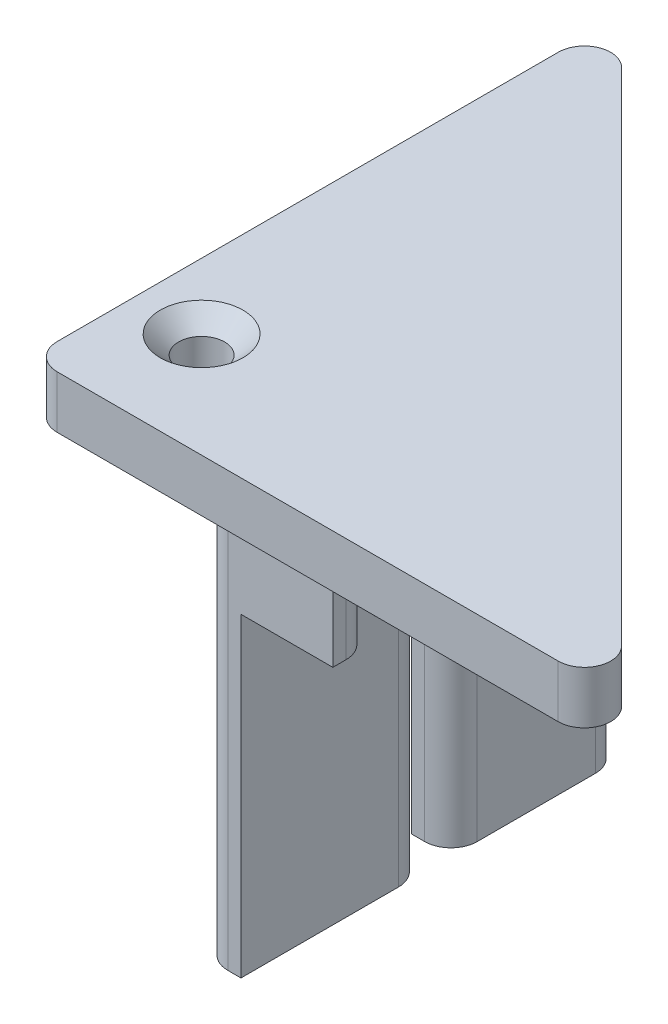
ISO-10303-21;
HEADER;
FILE_DESCRIPTION(('STEP AP214'),'2;1');
FILE_NAME('part.step','',(''),(''),'','','');
FILE_SCHEMA(('AUTOMOTIVE_DESIGN { 1 0 10303 214 1 1 1 1 }'));
ENDSEC;
DATA;
#1=APPLICATION_CONTEXT('core data for automotive mechanical design processes');
#2=APPLICATION_PROTOCOL_DEFINITION('international standard','automotive_design',2000,#1);
#3=PRODUCT_CONTEXT('',#1,'mechanical');
#4=PRODUCT('Part','Part','',(#3));
#5=PRODUCT_RELATED_PRODUCT_CATEGORY('part','',(#4));
#6=PRODUCT_DEFINITION_FORMATION('','',#4);
#7=PRODUCT_DEFINITION_CONTEXT('part definition',#1,'design');
#8=PRODUCT_DEFINITION('design','',#6,#7);
#9=PRODUCT_DEFINITION_SHAPE('','',#8);
#10=(LENGTH_UNIT() NAMED_UNIT(*) SI_UNIT(.MILLI.,.METRE.));
#11=(NAMED_UNIT(*) PLANE_ANGLE_UNIT() SI_UNIT($,.RADIAN.));
#12=(NAMED_UNIT(*) SI_UNIT($,.STERADIAN.) SOLID_ANGLE_UNIT());
#13=UNCERTAINTY_MEASURE_WITH_UNIT(LENGTH_MEASURE(1.E-05),#10,'distance_accuracy_value','');
#14=(GEOMETRIC_REPRESENTATION_CONTEXT(3) GLOBAL_UNCERTAINTY_ASSIGNED_CONTEXT((#13)) GLOBAL_UNIT_ASSIGNED_CONTEXT((#10,
#11,#12)) REPRESENTATION_CONTEXT('',''));
#15=CARTESIAN_POINT('',(0.,0.,0.));
#16=DIRECTION('',(0.,0.,1.));
#17=DIRECTION('',(1.,0.,0.));
#18=AXIS2_PLACEMENT_3D('',#15,#16,#17);
#19=CARTESIAN_POINT('',(0.,0.,0.));
#20=DIRECTION('',(0.,-1.,0.));
#21=DIRECTION('',(0.,0.,-1.));
#22=AXIS2_PLACEMENT_3D('',#19,#20,#21);
#23=PLANE('',#22);
#24=DIRECTION('',(1.,0.,0.));
#25=VECTOR('',#24,1.);
#26=CARTESIAN_POINT('',(0.,0.,3.18871125850726));
#27=LINE('',#26,#25);
#28=CARTESIAN_POINT('',(-12.8112887414927,0.,3.18871125850726));
#29=VERTEX_POINT('',#28);
#30=CARTESIAN_POINT('',(-11.2753903566305,0.,3.18871125850726));
#31=VERTEX_POINT('',#30);
#32=EDGE_CURVE('E248',#29,#31,#27,.T.);
#33=ORIENTED_EDGE('',*,*,#32,.T.);
#34=CARTESIAN_POINT('',(-11.2753903566305,0.,3.18871125850726));
#35=CARTESIAN_POINT('',(-11.1896950396168,0.,3.18872310792182));
#36=CARTESIAN_POINT('',(-11.1040498009896,0.,3.18458231875624));
#37=CARTESIAN_POINT('',(-10.9336097663003,0.,3.16856419805338));
#38=CARTESIAN_POINT('',(-10.848813875108,0.,3.15669863999265));
#39=CARTESIAN_POINT('',(-10.6815718867985,0.,3.12598248544023));
#40=CARTESIAN_POINT('',(-10.5991097883101,0.,3.10721775613916));
#41=CARTESIAN_POINT('',(-10.4358876936565,0.,3.0632724294391));
#42=CARTESIAN_POINT('',(-10.3551285305822,0.,3.03808876722678));
#43=CARTESIAN_POINT('',(-10.1660212365794,0.,2.97146420424771));
#44=CARTESIAN_POINT('',(-10.0585728980958,0.,2.92745964633977));
#45=CARTESIAN_POINT('',(-9.84798150876682,0.,2.83006554118897));
#46=CARTESIAN_POINT('',(-9.74484198360807,0.,2.77666848771994));
#47=CARTESIAN_POINT('',(-9.44128740929958,0.,2.60417371089743));
#48=CARTESIAN_POINT('',(-9.24765736216793,0.,2.47312060084458));
#49=CARTESIAN_POINT('',(-8.83817243563447,0.,2.16147102810283));
#50=CARTESIAN_POINT('',(-8.62600389271091,0.,1.97623377802154));
#51=CARTESIAN_POINT('',(-8.21507210968439,0.,1.59235280527151));
#52=CARTESIAN_POINT('',(-8.01629858237385,0.,1.39371961061531));
#53=CARTESIAN_POINT('',(-7.81550510963693,0.,1.19292762647639));
#54=CARTESIAN_POINT('',(-7.81339692449399,0.,1.19081944132885));
#55=CARTESIAN_POINT('',(-7.81128874149275,0.,1.18871125850726));
#56=B_SPLINE_CURVE_WITH_KNOTS('',3,(#34,#35,#36,#37,#38,#39,#40,#41,#42,#43,#44,#45,#46,#47,#48,
#49,#50,#51,#52,#53,#54,#55),.UNSPECIFIED.,.F.,.F.,(4,2,2,2,2,2,2,2,2,2,4),(0.,
0.256912595778472,0.513434539686404,0.766866291391,1.02041927520561,1.36819331305761,
1.71624655574816,2.41527069662684,3.25887239086227,4.10181864660848,4.11076291851909),.UNSPECIFIED.);
#57=CARTESIAN_POINT('',(-7.81128874149275,0.,1.18871125850726));
#58=VERTEX_POINT('',#57);
#59=EDGE_CURVE('E416',#31,#58,#56,.T.);
#60=ORIENTED_EDGE('',*,*,#59,.T.);
#61=DIRECTION('',(0.,0.,1.));
#62=VECTOR('',#61,1.);
#63=CARTESIAN_POINT('',(-7.81128874149275,0.,0.));
#64=LINE('',#63,#62);
#65=CARTESIAN_POINT('',(-7.81128874149275,0.,-7.81128874149275));
#66=VERTEX_POINT('',#65);
#67=EDGE_CURVE('E358',#58,#66,#64,.F.);
#68=ORIENTED_EDGE('',*,*,#67,.T.);
#69=DIRECTION('',(-0.707106781186548,0.,-0.707106781186547));
#70=VECTOR('',#69,1.);
#71=CARTESIAN_POINT('',(-22.8112887414927,0.,-22.8112887414927));
#72=LINE('',#71,#70);
#73=CARTESIAN_POINT('',(18.7744976961342,0.,18.7744976961342));
#74=VERTEX_POINT('',#73);
#75=EDGE_CURVE('E323',#74,#66,#72,.T.);
#76=ORIENTED_EDGE('',*,*,#75,.F.);
#77=CARTESIAN_POINT('',(17.3602841337611,0.,20.1887112585073));
#78=DIRECTION('',(0.,-1.,0.));
#79=DIRECTION('',(0.,0.,-1.));
#80=AXIS2_PLACEMENT_3D('',#77,#78,#79);
#81=CIRCLE('',#80,2.);
#82=CARTESIAN_POINT('',(17.3602841337611,0.,22.1887112585073));
#83=VERTEX_POINT('',#82);
#84=EDGE_CURVE('E335',#74,#83,#81,.T.);
#85=ORIENTED_EDGE('',*,*,#84,.T.);
#86=DIRECTION('',(1.,0.,0.));
#87=VECTOR('',#86,1.);
#88=CARTESIAN_POINT('',(-22.8112887414927,0.,22.1887112585073));
#89=LINE('',#88,#87);
#90=CARTESIAN_POINT('',(-20.8112887414927,0.,22.1887112585073));
#91=VERTEX_POINT('',#90);
#92=EDGE_CURVE('E308',#91,#83,#89,.T.);
#93=ORIENTED_EDGE('',*,*,#92,.F.);
#94=CARTESIAN_POINT('',(-20.8112887414927,0.,20.1887112585073));
#95=DIRECTION('',(0.,-1.,0.));
#96=DIRECTION('',(0.,0.,-1.));
#97=AXIS2_PLACEMENT_3D('',#94,#95,#96);
#98=CIRCLE('',#97,2.);
#99=CARTESIAN_POINT('',(-22.8112887414927,0.,20.1887112585072));
#100=VERTEX_POINT('',#99);
#101=EDGE_CURVE('E337',#91,#100,#98,.T.);
#102=ORIENTED_EDGE('',*,*,#101,.T.);
#103=DIRECTION('',(0.,0.,1.));
#104=VECTOR('',#103,1.);
#105=CARTESIAN_POINT('',(-22.8112887414927,0.,-22.8112887414927));
#106=LINE('',#105,#104);
#107=CARTESIAN_POINT('',(-22.8112887414927,0.,-17.9828616167466));
#108=VERTEX_POINT('',#107);
#109=EDGE_CURVE('E313',#108,#100,#106,.T.);
#110=ORIENTED_EDGE('',*,*,#109,.F.);
#111=CARTESIAN_POINT('',(-20.8112887414927,0.,-17.9828616167466));
#112=DIRECTION('',(0.,-1.,0.));
#113=DIRECTION('',(0.,0.,-1.));
#114=AXIS2_PLACEMENT_3D('',#111,#112,#113);
#115=CIRCLE('',#114,2.);
#116=CARTESIAN_POINT('',(-19.3970751791197,0.,-19.3970751791196));
#117=VERTEX_POINT('',#116);
#118=EDGE_CURVE('E332',#108,#117,#115,.T.);
#119=ORIENTED_EDGE('',*,*,#118,.T.);
#120=CARTESIAN_POINT('',(-7.81131625019968,-1.89184171800472E-10,-7.81131625019969));
#121=VERTEX_POINT('',#120);
#122=EDGE_CURVE('E322',#121,#117,#72,.T.);
#123=ORIENTED_EDGE('',*,*,#122,.F.);
#124=CARTESIAN_POINT('',(-7.81128874149275,0.,-7.81128874149276));
#125=CARTESIAN_POINT('',(-7.81339692564624,0.,-7.81339692455395));
#126=CARTESIAN_POINT('',(-7.81550511077952,0.,-7.81550510969863));
#127=CARTESIAN_POINT('',(-8.03070942479767,0.,-8.03070792011016));
#128=CARTESIAN_POINT('',(-8.24389551298576,0.,-8.24374190730681));
#129=CARTESIAN_POINT('',(-8.68663165574918,0.,-8.65314369731916));
#130=CARTESIAN_POINT('',(-8.91618317353816,0.,-8.84951000645054));
#131=CARTESIAN_POINT('',(-9.33784833090845,0.,-9.15728042141913));
#132=CARTESIAN_POINT('',(-9.52340691793126,0.,-9.27732642453521));
#133=CARTESIAN_POINT('',(-9.81347198810767,0.,-9.4349278098452));
#134=CARTESIAN_POINT('',(-9.91193072809967,0.,-9.48365066163156));
#135=CARTESIAN_POINT('',(-10.1126521120411,0.,-9.57242835571773));
#136=CARTESIAN_POINT('',(-10.2149119373207,0.,-9.61248947650809));
#137=CARTESIAN_POINT('',(-10.3954081005935,0.,-9.67339392715635));
#138=CARTESIAN_POINT('',(-10.4728774529477,0.,-9.69651979828418));
#139=CARTESIAN_POINT('',(-10.6293251353835,0.,-9.73683129724581));
#140=CARTESIAN_POINT('',(-10.7083028023864,0.,-9.75401947471049));
#141=CARTESIAN_POINT('',(-10.8682466677151,0.,-9.78210165786538));
#142=CARTESIAN_POINT('',(-10.9492250653657,0.,-9.79292712331315));
#143=CARTESIAN_POINT('',(-11.1119180182198,0.,-9.80753038510954));
#144=CARTESIAN_POINT('',(-11.1936334140157,0.,-9.8112987243296));
#145=CARTESIAN_POINT('',(-11.2753903566305,0.,-9.81128874149276));
#146=B_SPLINE_CURVE_WITH_KNOTS('',3,(#124,#125,#126,#127,#128,#129,#130,#131,#132,#133,#134,
#135,#136,#137,#138,#139,#140,#141,#142,#143,#144,#145),.UNSPECIFIED.,.F.,.F.,(4,2,2,2,2,2,2,2,
2,2,4),(0.,0.00894427191000628,0.913030753622195,1.8171981702534,2.47798425746542,
2.80721656621287,3.13620942353785,3.37854522598068,3.62077684030977,3.86557213547074,
4.11069524233373),.UNSPECIFIED.);
#147=CARTESIAN_POINT('',(-11.2753903566305,0.,-9.81128874149276));
#148=VERTEX_POINT('',#147);
#149=EDGE_CURVE('E58',#121,#148,#146,.T.);
#150=ORIENTED_EDGE('',*,*,#149,.T.);
#151=DIRECTION('',(-1.,0.,0.));
#152=VECTOR('',#151,1.);
#153=CARTESIAN_POINT('',(0.,0.,-9.81128874149276));
#154=LINE('',#153,#152);
#155=CARTESIAN_POINT('',(-12.8112887414927,0.,-9.81128874149276));
#156=VERTEX_POINT('',#155);
#157=EDGE_CURVE('E245',#148,#156,#154,.T.);
#158=ORIENTED_EDGE('',*,*,#157,.T.);
#159=DIRECTION('',(0.,0.,-1.));
#160=VECTOR('',#159,1.);
#161=CARTESIAN_POINT('',(-12.8112887414927,0.,0.));
#162=LINE('',#161,#160);
#163=EDGE_CURVE('E257',#29,#156,#162,.T.);
#164=ORIENTED_EDGE('',*,*,#163,.F.);
#165=EDGE_LOOP('',(#33,#60,#68,#76,#85,#93,#102,#110,#119,#123,#150,#158,#164));
#166=FACE_BOUND('',#165,.T.);
#167=CARTESIAN_POINT('',(-17.8112887414927,0.,14.1887112585073));
#168=DIRECTION('',(0.,1.,0.));
#169=DIRECTION('',(0.,0.,1.));
#170=AXIS2_PLACEMENT_3D('',#167,#168,#169);
#171=CIRCLE('',#170,1.75);
#172=CARTESIAN_POINT('',(-17.8112887414927,0.,15.9387112585073));
#173=VERTEX_POINT('',#172);
#174=EDGE_CURVE('E305',#173,#173,#171,.T.);
#175=ORIENTED_EDGE('',*,*,#174,.T.);
#176=EDGE_LOOP('',(#175));
#177=FACE_BOUND('',#176,.T.);
#178=DIRECTION('',(1.,0.,0.));
#179=VECTOR('',#178,1.);
#180=CARTESIAN_POINT('',(-9.81128874149275,0.,16.1887112585073));
#181=LINE('',#180,#179);
#182=CARTESIAN_POINT('',(-7.81128874149275,0.,16.1887112585073));
#183=VERTEX_POINT('',#182);
#184=CARTESIAN_POINT('',(-4.81128874149275,0.,16.1887112585073));
#185=VERTEX_POINT('',#184);
#186=EDGE_CURVE('E514',#183,#185,#181,.T.);
#187=ORIENTED_EDGE('',*,*,#186,.F.);
#188=DIRECTION('',(0.,0.,1.));
#189=VECTOR('',#188,1.);
#190=CARTESIAN_POINT('',(-7.81128874149275,0.,0.));
#191=LINE('',#190,#189);
#192=CARTESIAN_POINT('',(-7.81128874149275,0.,7.18871125850726));
#193=VERTEX_POINT('',#192);
#194=EDGE_CURVE('E361',#183,#193,#191,.F.);
#195=ORIENTED_EDGE('',*,*,#194,.T.);
#196=CARTESIAN_POINT('',(-11.2753903566305,0.,5.18871125850726));
#197=CARTESIAN_POINT('',(-11.1896950396169,0.,5.18869940909269));
#198=CARTESIAN_POINT('',(-11.1040498009896,0.,5.19284019825826));
#199=CARTESIAN_POINT('',(-10.9336097663005,0.,5.20885831896111));
#200=CARTESIAN_POINT('',(-10.8488138751082,0.,5.22072387702184));
#201=CARTESIAN_POINT('',(-10.6815718867986,0.,5.25144003157424));
#202=CARTESIAN_POINT('',(-10.5991097883102,0.,5.27020476087531));
#203=CARTESIAN_POINT('',(-10.4358876936566,0.,5.31415008757539));
#204=CARTESIAN_POINT('',(-10.3551285305822,0.,5.33933374978772));
#205=CARTESIAN_POINT('',(-10.1660212365794,0.,5.40595831276682));
#206=CARTESIAN_POINT('',(-10.0585728980957,0.,5.44996287067477));
#207=CARTESIAN_POINT('',(-9.84798150876671,0.,5.54735697582559));
#208=CARTESIAN_POINT('',(-9.74484198360793,0.,5.60075402929463));
#209=CARTESIAN_POINT('',(-9.44128740929951,0.,5.77324880611716));
#210=CARTESIAN_POINT('',(-9.24765736216799,0.,5.90430191617007));
#211=CARTESIAN_POINT('',(-8.83817243563437,0.,6.21595148891154));
#212=CARTESIAN_POINT('',(-8.62600389271043,0.,6.4011887389924));
#213=CARTESIAN_POINT('',(-8.21507210968496,0.,6.78506971174349));
#214=CARTESIAN_POINT('',(-8.01629858237587,0.,6.98370290640118));
#215=CARTESIAN_POINT('',(-7.81550510963696,0.,7.18449489053817));
#216=CARTESIAN_POINT('',(-7.81339692449401,0.,7.18660307568569));
#217=CARTESIAN_POINT('',(-7.81128874149275,0.,7.18871125850726));
#218=B_SPLINE_CURVE_WITH_KNOTS('',3,(#196,#197,#198,#199,#200,#201,#202,#203,#204,#205,#206,
#207,#208,#209,#210,#211,#212,#213,#214,#215,#216,#217),.UNSPECIFIED.,.F.,.F.,(4,2,2,2,2,2,2,2,
2,2,4),(0.,0.256912595778371,0.513434539686192,0.766866291390892,1.02041927520561,
1.3681933130577,1.71624655574833,2.41527069662684,3.25887239086218,4.10181864660849,
4.11076291851909),.UNSPECIFIED.);
#219=CARTESIAN_POINT('',(-11.2753903566305,0.,5.18871125850726));
#220=VERTEX_POINT('',#219);
#221=EDGE_CURVE('E424',#193,#220,#218,.F.);
#222=ORIENTED_EDGE('',*,*,#221,.T.);
#223=DIRECTION('',(1.,0.,0.));
#224=VECTOR('',#223,1.);
#225=CARTESIAN_POINT('',(0.,0.,5.18871125850726));
#226=LINE('',#225,#224);
#227=CARTESIAN_POINT('',(-12.8112887414927,0.,5.18871125850726));
#228=VERTEX_POINT('',#227);
#229=EDGE_CURVE('E290',#228,#220,#226,.T.);
#230=ORIENTED_EDGE('',*,*,#229,.F.);
#231=DIRECTION('',(0.,0.,-1.));
#232=VECTOR('',#231,1.);
#233=CARTESIAN_POINT('',(-12.8112887414927,0.,0.));
#234=LINE('',#233,#232);
#235=CARTESIAN_POINT('',(-12.8112887414927,0.,17.1887112585073));
#236=VERTEX_POINT('',#235);
#237=EDGE_CURVE('E276',#236,#228,#234,.T.);
#238=ORIENTED_EDGE('',*,*,#237,.F.);
#239=CARTESIAN_POINT('',(-10.8112887414927,0.,17.1887112585073));
#240=DIRECTION('',(0.,-1.,0.));
#241=DIRECTION('',(0.,0.,-1.));
#242=AXIS2_PLACEMENT_3D('',#239,#240,#241);
#243=CIRCLE('',#242,2.);
#244=CARTESIAN_POINT('',(-10.8112887414927,0.,19.1887112585073));
#245=VERTEX_POINT('',#244);
#246=EDGE_CURVE('E451',#236,#245,#243,.F.);
#247=ORIENTED_EDGE('',*,*,#246,.T.);
#248=DIRECTION('',(1.,0.,0.));
#249=VECTOR('',#248,1.);
#250=CARTESIAN_POINT('',(0.,0.,19.1887112585073));
#251=LINE('',#250,#249);
#252=CARTESIAN_POINT('',(-2.81128874149275,0.,19.1887112585073));
#253=VERTEX_POINT('',#252);
#254=EDGE_CURVE('E280',#245,#253,#251,.T.);
#255=ORIENTED_EDGE('',*,*,#254,.T.);
#256=DIRECTION('',(0.,0.,1.));
#257=VECTOR('',#256,1.);
#258=CARTESIAN_POINT('',(-2.81128874149275,0.,19.1887112585073));
#259=LINE('',#258,#257);
#260=CARTESIAN_POINT('',(-2.81128874149275,0.,18.1887112585073));
#261=VERTEX_POINT('',#260);
#262=EDGE_CURVE('E238',#261,#253,#259,.T.);
#263=ORIENTED_EDGE('',*,*,#262,.F.);
#264=CARTESIAN_POINT('',(-4.81128874149275,0.,18.1887112585073));
#265=DIRECTION('',(0.,-1.,0.));
#266=DIRECTION('',(0.,0.,-1.));
#267=AXIS2_PLACEMENT_3D('',#264,#265,#266);
#268=CIRCLE('',#267,2.);
#269=EDGE_CURVE('E11',#261,#185,#268,.F.);
#270=ORIENTED_EDGE('',*,*,#269,.T.);
#271=EDGE_LOOP('',(#187,#195,#222,#230,#238,#247,#255,#263,#270));
#272=FACE_BOUND('',#271,.T.);
#273=ADVANCED_FACE('F49',(#166,#177,#272),#23,.T.);
#274=CARTESIAN_POINT('',(-9.81128874149275,-32.,0.));
#275=DIRECTION('',(-1.,0.,0.));
#276=DIRECTION('',(0.,0.,1.));
#277=AXIS2_PLACEMENT_3D('',#274,#275,#276);
#278=PLANE('',#277);
#279=DIRECTION('',(0.,0.,1.));
#280=VECTOR('',#279,1.);
#281=CARTESIAN_POINT('',(-9.81128874149275,-32.,0.));
#282=LINE('',#281,#280);
#283=CARTESIAN_POINT('',(-9.81128874149275,-32.,7.18871125850726));
#284=VERTEX_POINT('',#283);
#285=CARTESIAN_POINT('',(-9.81128874149275,-32.,19.1887112585073));
#286=VERTEX_POINT('',#285);
#287=EDGE_CURVE('E283',#284,#286,#282,.T.);
#288=ORIENTED_EDGE('',*,*,#287,.F.);
#289=DIRECTION('',(0.,1.,0.));
#290=VECTOR('',#289,1.);
#291=CARTESIAN_POINT('',(-9.81128874149275,-32.,7.18871125850726));
#292=LINE('',#291,#290);
#293=CARTESIAN_POINT('',(-9.81128874149275,-2.,7.18871125850726));
#294=VERTEX_POINT('',#293);
#295=EDGE_CURVE('E414',#284,#294,#292,.T.);
#296=ORIENTED_EDGE('',*,*,#295,.T.);
#297=DIRECTION('',(0.,0.,1.));
#298=VECTOR('',#297,1.);
#299=CARTESIAN_POINT('',(-9.81128874149275,-2.,0.));
#300=LINE('',#299,#298);
#301=CARTESIAN_POINT('',(-9.81128874149275,-2.,16.1887112585073));
#302=VERTEX_POINT('',#301);
#303=EDGE_CURVE('E243',#294,#302,#300,.T.);
#304=ORIENTED_EDGE('',*,*,#303,.T.);
#305=DIRECTION('',(0.,1.,0.));
#306=VECTOR('',#305,1.);
#307=CARTESIAN_POINT('',(-9.81128874149275,-8.,16.1887112585073));
#308=LINE('',#307,#306);
#309=CARTESIAN_POINT('',(-9.81128874149275,-8.,16.1887112585073));
#310=VERTEX_POINT('',#309);
#311=EDGE_CURVE('E225',#310,#302,#308,.T.);
#312=ORIENTED_EDGE('',*,*,#311,.F.);
#313=DIRECTION('',(0.,0.,-1.));
#314=VECTOR('',#313,1.);
#315=CARTESIAN_POINT('',(-9.81128874149275,-8.,19.1887112585073));
#316=LINE('',#315,#314);
#317=CARTESIAN_POINT('',(-9.81128874149275,-8.,19.1887112585073));
#318=VERTEX_POINT('',#317);
#319=EDGE_CURVE('E229',#318,#310,#316,.T.);
#320=ORIENTED_EDGE('',*,*,#319,.F.);
#321=DIRECTION('',(0.,1.,0.));
#322=VECTOR('',#321,1.);
#323=CARTESIAN_POINT('',(-9.81128874149275,-32.,19.1887112585073));
#324=LINE('',#323,#322);
#325=EDGE_CURVE('E288',#286,#318,#324,.T.);
#326=ORIENTED_EDGE('',*,*,#325,.F.);
#327=EDGE_LOOP('',(#288,#296,#304,#312,#320,#326));
#328=FACE_BOUND('',#327,.T.);
#329=ADVANCED_FACE('F241',(#328),#278,.F.);
#330=CARTESIAN_POINT('',(0.,4.,0.));
#331=DIRECTION('',(0.,-1.,0.));
#332=DIRECTION('',(0.,0.,-1.));
#333=AXIS2_PLACEMENT_3D('',#330,#331,#332);
#334=PLANE('',#333);
#335=CARTESIAN_POINT('',(-17.8112887414927,4.,14.1887112585073));
#336=DIRECTION('',(0.,1.,0.));
#337=DIRECTION('',(0.,0.,1.));
#338=AXIS2_PLACEMENT_3D('',#335,#336,#337);
#339=CIRCLE('',#338,3.15);
#340=CARTESIAN_POINT('',(-17.8112887414927,4.,17.3387112585073));
#341=VERTEX_POINT('',#340);
#342=EDGE_CURVE('E299',#341,#341,#339,.T.);
#343=ORIENTED_EDGE('',*,*,#342,.F.);
#344=EDGE_LOOP('',(#343));
#345=FACE_BOUND('',#344,.T.);
#346=DIRECTION('',(0.,0.,1.));
#347=VECTOR('',#346,1.);
#348=CARTESIAN_POINT('',(-22.8112887414927,4.,-22.8112887414927));
#349=LINE('',#348,#347);
#350=CARTESIAN_POINT('',(-22.8112887414927,4.,-17.9828616167466));
#351=VERTEX_POINT('',#350);
#352=CARTESIAN_POINT('',(-22.8112887414927,4.,20.1887112585072));
#353=VERTEX_POINT('',#352);
#354=EDGE_CURVE('E316',#351,#353,#349,.T.);
#355=ORIENTED_EDGE('',*,*,#354,.T.);
#356=CARTESIAN_POINT('',(-20.8112887414927,4.,20.1887112585073));
#357=DIRECTION('',(0.,-1.,0.));
#358=DIRECTION('',(0.,0.,-1.));
#359=AXIS2_PLACEMENT_3D('',#356,#357,#358);
#360=CIRCLE('',#359,2.);
#361=CARTESIAN_POINT('',(-20.8112887414927,4.,22.1887112585073));
#362=VERTEX_POINT('',#361);
#363=EDGE_CURVE('E348',#353,#362,#360,.F.);
#364=ORIENTED_EDGE('',*,*,#363,.T.);
#365=DIRECTION('',(1.,0.,0.));
#366=VECTOR('',#365,1.);
#367=CARTESIAN_POINT('',(-22.8112887414927,4.,22.1887112585073));
#368=LINE('',#367,#366);
#369=CARTESIAN_POINT('',(17.3602841337611,4.,22.1887112585073));
#370=VERTEX_POINT('',#369);
#371=EDGE_CURVE('E309',#362,#370,#368,.T.);
#372=ORIENTED_EDGE('',*,*,#371,.T.);
#373=CARTESIAN_POINT('',(17.3602841337611,4.,20.1887112585073));
#374=DIRECTION('',(0.,-1.,0.));
#375=DIRECTION('',(0.,0.,-1.));
#376=AXIS2_PLACEMENT_3D('',#373,#374,#375);
#377=CIRCLE('',#376,2.);
#378=CARTESIAN_POINT('',(18.7744976961342,4.,18.7744976961342));
#379=VERTEX_POINT('',#378);
#380=EDGE_CURVE('E346',#370,#379,#377,.F.);
#381=ORIENTED_EDGE('',*,*,#380,.T.);
#382=DIRECTION('',(-0.707106781186548,0.,-0.707106781186547));
#383=VECTOR('',#382,1.);
#384=CARTESIAN_POINT('',(-22.8112887414927,4.,-22.8112887414927));
#385=LINE('',#384,#383);
#386=CARTESIAN_POINT('',(-19.3970751791197,4.,-19.3970751791196));
#387=VERTEX_POINT('',#386);
#388=EDGE_CURVE('E312',#379,#387,#385,.T.);
#389=ORIENTED_EDGE('',*,*,#388,.T.);
#390=CARTESIAN_POINT('',(-20.8112887414927,4.,-17.9828616167466));
#391=DIRECTION('',(0.,-1.,0.));
#392=DIRECTION('',(0.,0.,-1.));
#393=AXIS2_PLACEMENT_3D('',#390,#391,#392);
#394=CIRCLE('',#393,2.);
#395=EDGE_CURVE('E344',#387,#351,#394,.F.);
#396=ORIENTED_EDGE('',*,*,#395,.T.);
#397=EDGE_LOOP('',(#355,#364,#372,#381,#389,#396));
#398=FACE_BOUND('',#397,.T.);
#399=ADVANCED_FACE('F440',(#345,#398),#334,.F.);
#400=CARTESIAN_POINT('',(-22.8112887414927,4.,22.1887112585073));
#401=DIRECTION('',(0.,0.,-1.));
#402=DIRECTION('',(-1.,0.,0.));
#403=AXIS2_PLACEMENT_3D('',#400,#401,#402);
#404=PLANE('',#403);
#405=ORIENTED_EDGE('',*,*,#371,.F.);
#406=DIRECTION('',(0.,-1.,0.));
#407=VECTOR('',#406,1.);
#408=CARTESIAN_POINT('',(-20.8112887414927,4.,22.1887112585073));
#409=LINE('',#408,#407);
#410=EDGE_CURVE('E329',#362,#91,#409,.T.);
#411=ORIENTED_EDGE('',*,*,#410,.T.);
#412=ORIENTED_EDGE('',*,*,#92,.T.);
#413=DIRECTION('',(0.,-1.,0.));
#414=VECTOR('',#413,1.);
#415=CARTESIAN_POINT('',(17.3602841337611,4.,22.1887112585073));
#416=LINE('',#415,#414);
#417=EDGE_CURVE('E319',#83,#370,#416,.F.);
#418=ORIENTED_EDGE('',*,*,#417,.T.);
#419=EDGE_LOOP('',(#405,#411,#412,#418));
#420=FACE_BOUND('',#419,.T.);
#421=ADVANCED_FACE('F579',(#420),#404,.F.);
#422=CARTESIAN_POINT('',(-22.8112887414927,4.,-22.8112887414927));
#423=DIRECTION('',(-0.707106781186547,0.,0.707106781186548));
#424=DIRECTION('',(0.707106781186548,0.,0.707106781186547));
#425=AXIS2_PLACEMENT_3D('',#422,#423,#424);
#426=PLANE('',#425);
#427=CARTESIAN_POINT('',(-7.81128874149275,-2.,-7.81128874149275));
#428=DIRECTION('',(-0.707106781186547,0.,0.707106781186548));
#429=DIRECTION('',(0.707106781186548,0.,0.707106781186547));
#430=AXIS2_PLACEMENT_3D('',#427,#428,#429);
#431=ELLIPSE('',#430,2.82842712474619,2.);
#432=EDGE_CURVE('E367',#66,#121,#431,.T.);
#433=ORIENTED_EDGE('',*,*,#432,.T.);
#434=ORIENTED_EDGE('',*,*,#122,.T.);
#435=DIRECTION('',(0.,-1.,0.));
#436=VECTOR('',#435,1.);
#437=CARTESIAN_POINT('',(-19.3970751791196,4.,-19.3970751791196));
#438=LINE('',#437,#436);
#439=EDGE_CURVE('E350',#117,#387,#438,.F.);
#440=ORIENTED_EDGE('',*,*,#439,.T.);
#441=ORIENTED_EDGE('',*,*,#388,.F.);
#442=DIRECTION('',(0.,-1.,0.));
#443=VECTOR('',#442,1.);
#444=CARTESIAN_POINT('',(18.7744976961342,4.,18.7744976961342));
#445=LINE('',#444,#443);
#446=EDGE_CURVE('E352',#379,#74,#445,.T.);
#447=ORIENTED_EDGE('',*,*,#446,.T.);
#448=ORIENTED_EDGE('',*,*,#75,.T.);
#449=EDGE_LOOP('',(#433,#434,#440,#441,#447,#448));
#450=FACE_BOUND('',#449,.T.);
#451=ADVANCED_FACE('F568',(#450),#426,.F.);
#452=CARTESIAN_POINT('',(-22.8112887414927,4.,-22.8112887414927));
#453=DIRECTION('',(1.,0.,0.));
#454=DIRECTION('',(0.,0.,-1.));
#455=AXIS2_PLACEMENT_3D('',#452,#453,#454);
#456=PLANE('',#455);
#457=ORIENTED_EDGE('',*,*,#109,.T.);
#458=DIRECTION('',(0.,-1.,0.));
#459=VECTOR('',#458,1.);
#460=CARTESIAN_POINT('',(-22.8112887414927,4.,20.1887112585073));
#461=LINE('',#460,#459);
#462=EDGE_CURVE('E342',#100,#353,#461,.F.);
#463=ORIENTED_EDGE('',*,*,#462,.T.);
#464=ORIENTED_EDGE('',*,*,#354,.F.);
#465=DIRECTION('',(0.,-1.,0.));
#466=VECTOR('',#465,1.);
#467=CARTESIAN_POINT('',(-22.8112887414927,4.,-17.9828616167466));
#468=LINE('',#467,#466);
#469=EDGE_CURVE('E339',#351,#108,#468,.T.);
#470=ORIENTED_EDGE('',*,*,#469,.T.);
#471=EDGE_LOOP('',(#457,#463,#464,#470));
#472=FACE_BOUND('',#471,.T.);
#473=ADVANCED_FACE('F442',(#472),#456,.F.);
#474=CARTESIAN_POINT('',(-17.8112887414927,4.,14.1887112585073));
#475=DIRECTION('',(0.,-1.,0.));
#476=DIRECTION('',(0.,0.,-1.));
#477=AXIS2_PLACEMENT_3D('',#474,#475,#476);
#478=CYLINDRICAL_SURFACE('',#477,1.75);
#479=CARTESIAN_POINT('',(-17.8112887414927,2.6,14.1887112585073));
#480=DIRECTION('',(0.,1.,0.));
#481=DIRECTION('',(0.,0.,1.));
#482=AXIS2_PLACEMENT_3D('',#479,#480,#481);
#483=CIRCLE('',#482,1.75);
#484=CARTESIAN_POINT('',(-17.8112887414927,2.6,15.9387112585073));
#485=VERTEX_POINT('',#484);
#486=EDGE_CURVE('E302',#485,#485,#483,.F.);
#487=ORIENTED_EDGE('',*,*,#486,.F.);
#488=EDGE_LOOP('',(#487));
#489=FACE_BOUND('',#488,.T.);
#490=ORIENTED_EDGE('',*,*,#174,.F.);
#491=EDGE_LOOP('',(#490));
#492=FACE_BOUND('',#491,.T.);
#493=ADVANCED_FACE('F561',(#489,#492),#478,.F.);
#494=CARTESIAN_POINT('',(-17.8112887414927,4.,14.1887112585073));
#495=DIRECTION('',(0.,1.,0.));
#496=DIRECTION('',(0.,0.,1.));
#497=AXIS2_PLACEMENT_3D('',#494,#495,#496);
#498=CONICAL_SURFACE('',#497,3.15,0.785398163397448);
#499=ORIENTED_EDGE('',*,*,#486,.T.);
#500=EDGE_LOOP('',(#499));
#501=FACE_BOUND('',#500,.T.);
#502=ORIENTED_EDGE('',*,*,#342,.T.);
#503=EDGE_LOOP('',(#502));
#504=FACE_BOUND('',#503,.T.);
#505=ADVANCED_FACE('F558',(#501,#504),#498,.F.);
#506=CARTESIAN_POINT('',(-20.8112887414927,4.,20.1887112585073));
#507=DIRECTION('',(0.,-1.,0.));
#508=DIRECTION('',(0.,0.,-1.));
#509=AXIS2_PLACEMENT_3D('',#506,#507,#508);
#510=CYLINDRICAL_SURFACE('',#509,2.);
#511=ORIENTED_EDGE('',*,*,#363,.F.);
#512=ORIENTED_EDGE('',*,*,#462,.F.);
#513=ORIENTED_EDGE('',*,*,#101,.F.);
#514=ORIENTED_EDGE('',*,*,#410,.F.);
#515=EDGE_LOOP('',(#511,#512,#513,#514));
#516=FACE_BOUND('',#515,.T.);
#517=ADVANCED_FACE('F560',(#516),#510,.T.);
#518=CARTESIAN_POINT('',(17.3602841337611,4.,20.1887112585073));
#519=DIRECTION('',(0.,-1.,0.));
#520=DIRECTION('',(0.,0.,-1.));
#521=AXIS2_PLACEMENT_3D('',#518,#519,#520);
#522=CYLINDRICAL_SURFACE('',#521,2.);
#523=ORIENTED_EDGE('',*,*,#380,.F.);
#524=ORIENTED_EDGE('',*,*,#417,.F.);
#525=ORIENTED_EDGE('',*,*,#84,.F.);
#526=ORIENTED_EDGE('',*,*,#446,.F.);
#527=EDGE_LOOP('',(#523,#524,#525,#526));
#528=FACE_BOUND('',#527,.T.);
#529=ADVANCED_FACE('F553',(#528),#522,.T.);
#530=CARTESIAN_POINT('',(-20.8112887414927,4.,-17.9828616167466));
#531=DIRECTION('',(0.,-1.,0.));
#532=DIRECTION('',(0.,0.,-1.));
#533=AXIS2_PLACEMENT_3D('',#530,#531,#532);
#534=CYLINDRICAL_SURFACE('',#533,2.);
#535=ORIENTED_EDGE('',*,*,#395,.F.);
#536=ORIENTED_EDGE('',*,*,#439,.F.);
#537=ORIENTED_EDGE('',*,*,#118,.F.);
#538=ORIENTED_EDGE('',*,*,#469,.F.);
#539=EDGE_LOOP('',(#535,#536,#537,#538));
#540=FACE_BOUND('',#539,.T.);
#541=ADVANCED_FACE('F545',(#540),#534,.T.);
#542=CARTESIAN_POINT('',(-12.8112887414927,-32.,0.));
#543=DIRECTION('',(1.,0.,0.));
#544=DIRECTION('',(0.,0.,-1.));
#545=AXIS2_PLACEMENT_3D('',#542,#543,#544);
#546=PLANE('',#545);
#547=DIRECTION('',(0.,0.,-1.));
#548=VECTOR('',#547,1.);
#549=CARTESIAN_POINT('',(-12.8112887414927,-32.,0.));
#550=LINE('',#549,#548);
#551=CARTESIAN_POINT('',(-12.8112887414927,-32.,17.1887112585073));
#552=VERTEX_POINT('',#551);
#553=CARTESIAN_POINT('',(-12.8112887414927,-32.,5.18871125850726));
#554=VERTEX_POINT('',#553);
#555=EDGE_CURVE('E277',#552,#554,#550,.T.);
#556=ORIENTED_EDGE('',*,*,#555,.F.);
#557=DIRECTION('',(0.,1.,0.));
#558=VECTOR('',#557,1.);
#559=CARTESIAN_POINT('',(-12.8112887414927,0.,17.1887112585073));
#560=LINE('',#559,#558);
#561=EDGE_CURVE('E386',#552,#236,#560,.T.);
#562=ORIENTED_EDGE('',*,*,#561,.T.);
#563=ORIENTED_EDGE('',*,*,#237,.T.);
#564=DIRECTION('',(0.,1.,0.));
#565=VECTOR('',#564,1.);
#566=CARTESIAN_POINT('',(-12.8112887414927,-32.,5.18871125850726));
#567=LINE('',#566,#565);
#568=EDGE_CURVE('E296',#554,#228,#567,.T.);
#569=ORIENTED_EDGE('',*,*,#568,.F.);
#570=EDGE_LOOP('',(#556,#562,#563,#569));
#571=FACE_BOUND('',#570,.T.);
#572=ADVANCED_FACE('F543',(#571),#546,.F.);
#573=CARTESIAN_POINT('',(0.,-32.,5.18871125850726));
#574=DIRECTION('',(0.,0.,1.));
#575=DIRECTION('',(1.,0.,0.));
#576=AXIS2_PLACEMENT_3D('',#573,#574,#575);
#577=PLANE('',#576);
#578=ORIENTED_EDGE('',*,*,#229,.T.);
#579=CARTESIAN_POINT('',(-7.81128874149275,-2.,5.18871125850726));
#580=DIRECTION('',(0.,0.,1.));
#581=DIRECTION('',(1.,0.,0.));
#582=AXIS2_PLACEMENT_3D('',#579,#580,#581);
#583=CIRCLE('',#582,4.);
#584=CARTESIAN_POINT('',(-11.8112887414927,-2.,5.18871125850726));
#585=VERTEX_POINT('',#584);
#586=EDGE_CURVE('E381',#220,#585,#583,.T.);
#587=ORIENTED_EDGE('',*,*,#586,.T.);
#588=DIRECTION('',(0.,1.,0.));
#589=VECTOR('',#588,1.);
#590=CARTESIAN_POINT('',(-11.8112887414927,-32.,5.18871125850726));
#591=LINE('',#590,#589);
#592=CARTESIAN_POINT('',(-11.8112887414927,-32.,5.18871125850726));
#593=VERTEX_POINT('',#592);
#594=EDGE_CURVE('E379',#585,#593,#591,.F.);
#595=ORIENTED_EDGE('',*,*,#594,.T.);
#596=DIRECTION('',(1.,0.,0.));
#597=VECTOR('',#596,1.);
#598=CARTESIAN_POINT('',(0.,-32.,5.18871125850726));
#599=LINE('',#598,#597);
#600=EDGE_CURVE('E279',#554,#593,#599,.T.);
#601=ORIENTED_EDGE('',*,*,#600,.F.);
#602=ORIENTED_EDGE('',*,*,#568,.T.);
#603=EDGE_LOOP('',(#578,#587,#595,#601,#602));
#604=FACE_BOUND('',#603,.T.);
#605=ADVANCED_FACE('F526',(#604),#577,.F.);
#606=CARTESIAN_POINT('',(0.,-32.,19.1887112585073));
#607=DIRECTION('',(0.,0.,1.));
#608=DIRECTION('',(1.,0.,0.));
#609=AXIS2_PLACEMENT_3D('',#606,#607,#608);
#610=PLANE('',#609);
#611=ORIENTED_EDGE('',*,*,#254,.F.);
#612=DIRECTION('',(0.,1.,0.));
#613=VECTOR('',#612,1.);
#614=CARTESIAN_POINT('',(-10.8112887414927,-32.,19.1887112585073));
#615=LINE('',#614,#613);
#616=CARTESIAN_POINT('',(-10.8112887414927,-32.,19.1887112585073));
#617=VERTEX_POINT('',#616);
#618=EDGE_CURVE('E389',#245,#617,#615,.F.);
#619=ORIENTED_EDGE('',*,*,#618,.T.);
#620=DIRECTION('',(1.,0.,0.));
#621=VECTOR('',#620,1.);
#622=CARTESIAN_POINT('',(0.,-32.,19.1887112585073));
#623=LINE('',#622,#621);
#624=EDGE_CURVE('E285',#617,#286,#623,.T.);
#625=ORIENTED_EDGE('',*,*,#624,.T.);
#626=ORIENTED_EDGE('',*,*,#325,.T.);
#627=DIRECTION('',(-1.,0.,0.));
#628=VECTOR('',#627,1.);
#629=CARTESIAN_POINT('',(-9.81128874149275,-8.,19.1887112585073));
#630=LINE('',#629,#628);
#631=CARTESIAN_POINT('',(-2.81128874149275,-8.,19.1887112585073));
#632=VERTEX_POINT('',#631);
#633=EDGE_CURVE('E234',#632,#318,#630,.T.);
#634=ORIENTED_EDGE('',*,*,#633,.F.);
#635=DIRECTION('',(0.,1.,0.));
#636=VECTOR('',#635,1.);
#637=CARTESIAN_POINT('',(-2.81128874149275,-8.,19.1887112585073));
#638=LINE('',#637,#636);
#639=EDGE_CURVE('E246',#632,#253,#638,.T.);
#640=ORIENTED_EDGE('',*,*,#639,.T.);
#641=EDGE_LOOP('',(#611,#619,#625,#626,#634,#640));
#642=FACE_BOUND('',#641,.T.);
#643=ADVANCED_FACE('F535',(#642),#610,.T.);
#644=CARTESIAN_POINT('',(0.,-32.,0.));
#645=DIRECTION('',(0.,-1.,0.));
#646=DIRECTION('',(0.,0.,-1.));
#647=AXIS2_PLACEMENT_3D('',#644,#645,#646);
#648=PLANE('',#647);
#649=ORIENTED_EDGE('',*,*,#624,.F.);
#650=CARTESIAN_POINT('',(-10.8112887414927,-32.,17.1887112585073));
#651=DIRECTION('',(0.,-1.,0.));
#652=DIRECTION('',(0.,0.,-1.));
#653=AXIS2_PLACEMENT_3D('',#650,#651,#652);
#654=CIRCLE('',#653,2.);
#655=EDGE_CURVE('E393',#617,#552,#654,.T.);
#656=ORIENTED_EDGE('',*,*,#655,.T.);
#657=ORIENTED_EDGE('',*,*,#555,.T.);
#658=ORIENTED_EDGE('',*,*,#600,.T.);
#659=CARTESIAN_POINT('',(-11.8112887414927,-32.,7.18871125850726));
#660=DIRECTION('',(0.,-1.,0.));
#661=DIRECTION('',(0.,0.,-1.));
#662=AXIS2_PLACEMENT_3D('',#659,#660,#661);
#663=CIRCLE('',#662,2.);
#664=EDGE_CURVE('E391',#593,#284,#663,.T.);
#665=ORIENTED_EDGE('',*,*,#664,.T.);
#666=ORIENTED_EDGE('',*,*,#287,.T.);
#667=EDGE_LOOP('',(#649,#656,#657,#658,#665,#666));
#668=FACE_BOUND('',#667,.T.);
#669=ADVANCED_FACE('F541',(#668),#648,.T.);
#670=CARTESIAN_POINT('',(0.,-32.,-9.81128874149276));
#671=DIRECTION('',(0.,0.,-1.));
#672=DIRECTION('',(-1.,0.,0.));
#673=AXIS2_PLACEMENT_3D('',#670,#671,#672);
#674=PLANE('',#673);
#675=ORIENTED_EDGE('',*,*,#157,.F.);
#676=CARTESIAN_POINT('',(-7.81128874149275,-2.,-9.81128874149276));
#677=DIRECTION('',(0.,0.,-1.));
#678=DIRECTION('',(-1.,0.,0.));
#679=AXIS2_PLACEMENT_3D('',#676,#677,#678);
#680=CIRCLE('',#679,4.);
#681=CARTESIAN_POINT('',(-11.8112887414927,-2.,-9.81128874149276));
#682=VERTEX_POINT('',#681);
#683=EDGE_CURVE('E402',#148,#682,#680,.F.);
#684=ORIENTED_EDGE('',*,*,#683,.T.);
#685=DIRECTION('',(0.,1.,0.));
#686=VECTOR('',#685,1.);
#687=CARTESIAN_POINT('',(-11.8112887414927,-32.,-9.81128874149276));
#688=LINE('',#687,#686);
#689=CARTESIAN_POINT('',(-11.8112887414927,-32.,-9.81128874149276));
#690=VERTEX_POINT('',#689);
#691=EDGE_CURVE('E400',#682,#690,#688,.F.);
#692=ORIENTED_EDGE('',*,*,#691,.T.);
#693=DIRECTION('',(-1.,0.,0.));
#694=VECTOR('',#693,1.);
#695=CARTESIAN_POINT('',(0.,-32.,-9.81128874149276));
#696=LINE('',#695,#694);
#697=CARTESIAN_POINT('',(-12.8112887414927,-32.,-9.81128874149276));
#698=VERTEX_POINT('',#697);
#699=EDGE_CURVE('E254',#690,#698,#696,.T.);
#700=ORIENTED_EDGE('',*,*,#699,.T.);
#701=DIRECTION('',(0.,1.,0.));
#702=VECTOR('',#701,1.);
#703=CARTESIAN_POINT('',(-12.8112887414927,-32.,-9.81128874149276));
#704=LINE('',#703,#702);
#705=EDGE_CURVE('E265',#698,#156,#704,.T.);
#706=ORIENTED_EDGE('',*,*,#705,.T.);
#707=EDGE_LOOP('',(#675,#684,#692,#700,#706));
#708=FACE_BOUND('',#707,.T.);
#709=ADVANCED_FACE('F603',(#708),#674,.T.);
#710=CARTESIAN_POINT('',(-9.81128874149275,-32.,0.));
#711=DIRECTION('',(-1.,0.,0.));
#712=DIRECTION('',(0.,0.,1.));
#713=AXIS2_PLACEMENT_3D('',#710,#711,#712);
#714=PLANE('',#713);
#715=DIRECTION('',(0.,0.,1.));
#716=VECTOR('',#715,1.);
#717=CARTESIAN_POINT('',(-9.81128874149275,-32.,0.));
#718=LINE('',#717,#716);
#719=CARTESIAN_POINT('',(-9.81128874149275,-32.,-7.81128874149276));
#720=VERTEX_POINT('',#719);
#721=CARTESIAN_POINT('',(-9.81128874149275,-32.,1.18871125850726));
#722=VERTEX_POINT('',#721);
#723=EDGE_CURVE('E256',#720,#722,#718,.T.);
#724=ORIENTED_EDGE('',*,*,#723,.F.);
#725=DIRECTION('',(0.,1.,0.));
#726=VECTOR('',#725,1.);
#727=CARTESIAN_POINT('',(-9.81128874149275,-2.,-7.81128874149276));
#728=LINE('',#727,#726);
#729=CARTESIAN_POINT('',(-9.81128874149275,-2.,-7.81128874149276));
#730=VERTEX_POINT('',#729);
#731=EDGE_CURVE('E397',#720,#730,#728,.T.);
#732=ORIENTED_EDGE('',*,*,#731,.T.);
#733=DIRECTION('',(0.,0.,1.));
#734=VECTOR('',#733,1.);
#735=CARTESIAN_POINT('',(-9.81128874149275,-2.,0.));
#736=LINE('',#735,#734);
#737=CARTESIAN_POINT('',(-9.81128874149275,-2.,1.18871125850726));
#738=VERTEX_POINT('',#737);
#739=EDGE_CURVE('E364',#730,#738,#736,.T.);
#740=ORIENTED_EDGE('',*,*,#739,.T.);
#741=DIRECTION('',(0.,1.,0.));
#742=VECTOR('',#741,1.);
#743=CARTESIAN_POINT('',(-9.81128874149275,-32.,1.18871125850726));
#744=LINE('',#743,#742);
#745=EDGE_CURVE('E395',#738,#722,#744,.F.);
#746=ORIENTED_EDGE('',*,*,#745,.T.);
#747=EDGE_LOOP('',(#724,#732,#740,#746));
#748=FACE_BOUND('',#747,.T.);
#749=ADVANCED_FACE('F509',(#748),#714,.F.);
#750=CARTESIAN_POINT('',(0.,-32.,3.18871125850726));
#751=DIRECTION('',(0.,0.,1.));
#752=DIRECTION('',(1.,0.,0.));
#753=AXIS2_PLACEMENT_3D('',#750,#751,#752);
#754=PLANE('',#753);
#755=DIRECTION('',(0.,1.,0.));
#756=VECTOR('',#755,1.);
#757=CARTESIAN_POINT('',(-11.8112887414927,-2.,3.18871125850726));
#758=LINE('',#757,#756);
#759=CARTESIAN_POINT('',(-11.8112887414927,-32.,3.18871125850726));
#760=VERTEX_POINT('',#759);
#761=CARTESIAN_POINT('',(-11.8112887414927,-2.,3.18871125850726));
#762=VERTEX_POINT('',#761);
#763=EDGE_CURVE('E370',#760,#762,#758,.T.);
#764=ORIENTED_EDGE('',*,*,#763,.T.);
#765=CARTESIAN_POINT('',(-7.81128874149275,-2.,3.18871125850726));
#766=DIRECTION('',(0.,0.,1.));
#767=DIRECTION('',(1.,0.,0.));
#768=AXIS2_PLACEMENT_3D('',#765,#766,#767);
#769=CIRCLE('',#768,4.);
#770=EDGE_CURVE('E372',#762,#31,#769,.F.);
#771=ORIENTED_EDGE('',*,*,#770,.T.);
#772=ORIENTED_EDGE('',*,*,#32,.F.);
#773=DIRECTION('',(0.,1.,0.));
#774=VECTOR('',#773,1.);
#775=CARTESIAN_POINT('',(-12.8112887414927,-32.,3.18871125850726));
#776=LINE('',#775,#774);
#777=CARTESIAN_POINT('',(-12.8112887414927,-32.,3.18871125850726));
#778=VERTEX_POINT('',#777);
#779=EDGE_CURVE('E273',#778,#29,#776,.T.);
#780=ORIENTED_EDGE('',*,*,#779,.F.);
#781=DIRECTION('',(1.,0.,0.));
#782=VECTOR('',#781,1.);
#783=CARTESIAN_POINT('',(0.,-32.,3.18871125850726));
#784=LINE('',#783,#782);
#785=EDGE_CURVE('E260',#778,#760,#784,.T.);
#786=ORIENTED_EDGE('',*,*,#785,.T.);
#787=EDGE_LOOP('',(#764,#771,#772,#780,#786));
#788=FACE_BOUND('',#787,.T.);
#789=ADVANCED_FACE('F495',(#788),#754,.T.);
#790=CARTESIAN_POINT('',(-12.8112887414927,-32.,0.));
#791=DIRECTION('',(1.,0.,0.));
#792=DIRECTION('',(0.,0.,-1.));
#793=AXIS2_PLACEMENT_3D('',#790,#791,#792);
#794=PLANE('',#793);
#795=ORIENTED_EDGE('',*,*,#163,.T.);
#796=ORIENTED_EDGE('',*,*,#705,.F.);
#797=DIRECTION('',(0.,0.,-1.));
#798=VECTOR('',#797,1.);
#799=CARTESIAN_POINT('',(-12.8112887414927,-32.,0.));
#800=LINE('',#799,#798);
#801=EDGE_CURVE('E263',#778,#698,#800,.T.);
#802=ORIENTED_EDGE('',*,*,#801,.F.);
#803=ORIENTED_EDGE('',*,*,#779,.T.);
#804=EDGE_LOOP('',(#795,#796,#802,#803));
#805=FACE_BOUND('',#804,.T.);
#806=ADVANCED_FACE('F500',(#805),#794,.F.);
#807=CARTESIAN_POINT('',(0.,-32.,0.));
#808=DIRECTION('',(0.,-1.,0.));
#809=DIRECTION('',(0.,0.,-1.));
#810=AXIS2_PLACEMENT_3D('',#807,#808,#809);
#811=PLANE('',#810);
#812=ORIENTED_EDGE('',*,*,#699,.F.);
#813=CARTESIAN_POINT('',(-11.8112887414927,-32.,-7.81128874149276));
#814=DIRECTION('',(0.,-1.,0.));
#815=DIRECTION('',(0.,0.,-1.));
#816=AXIS2_PLACEMENT_3D('',#813,#814,#815);
#817=CIRCLE('',#816,2.);
#818=EDGE_CURVE('E406',#690,#720,#817,.T.);
#819=ORIENTED_EDGE('',*,*,#818,.T.);
#820=ORIENTED_EDGE('',*,*,#723,.T.);
#821=CARTESIAN_POINT('',(-11.8112887414927,-32.,1.18871125850726));
#822=DIRECTION('',(0.,-1.,0.));
#823=DIRECTION('',(0.,0.,-1.));
#824=AXIS2_PLACEMENT_3D('',#821,#822,#823);
#825=CIRCLE('',#824,2.);
#826=EDGE_CURVE('E404',#722,#760,#825,.T.);
#827=ORIENTED_EDGE('',*,*,#826,.T.);
#828=ORIENTED_EDGE('',*,*,#785,.F.);
#829=ORIENTED_EDGE('',*,*,#801,.T.);
#830=EDGE_LOOP('',(#812,#819,#820,#827,#828,#829));
#831=FACE_BOUND('',#830,.T.);
#832=ADVANCED_FACE('F492',(#831),#811,.T.);
#833=CARTESIAN_POINT('',(-9.81128874149275,-8.,16.1887112585073));
#834=DIRECTION('',(0.,0.,1.));
#835=DIRECTION('',(1.,0.,0.));
#836=AXIS2_PLACEMENT_3D('',#833,#834,#835);
#837=PLANE('',#836);
#838=ORIENTED_EDGE('',*,*,#186,.T.);
#839=DIRECTION('',(0.,1.,0.));
#840=VECTOR('',#839,1.);
#841=CARTESIAN_POINT('',(-4.81128874149275,-8.,16.1887112585073));
#842=LINE('',#841,#840);
#843=CARTESIAN_POINT('',(-4.81128874149275,-8.,16.1887112585073));
#844=VERTEX_POINT('',#843);
#845=EDGE_CURVE('E66',#185,#844,#842,.F.);
#846=ORIENTED_EDGE('',*,*,#845,.T.);
#847=DIRECTION('',(1.,0.,0.));
#848=VECTOR('',#847,1.);
#849=CARTESIAN_POINT('',(-9.81128874149275,-8.,16.1887112585073));
#850=LINE('',#849,#848);
#851=EDGE_CURVE('E221',#310,#844,#850,.T.);
#852=ORIENTED_EDGE('',*,*,#851,.F.);
#853=ORIENTED_EDGE('',*,*,#311,.T.);
#854=CARTESIAN_POINT('',(-7.81128874149275,-2.,16.1887112585073));
#855=DIRECTION('',(0.,0.,1.));
#856=DIRECTION('',(1.,0.,0.));
#857=AXIS2_PLACEMENT_3D('',#854,#855,#856);
#858=CIRCLE('',#857,2.);
#859=EDGE_CURVE('E356',#302,#183,#858,.F.);
#860=ORIENTED_EDGE('',*,*,#859,.T.);
#861=EDGE_LOOP('',(#838,#846,#852,#853,#860));
#862=FACE_BOUND('',#861,.T.);
#863=ADVANCED_FACE('F223',(#862),#837,.F.);
#864=CARTESIAN_POINT('',(-2.81128874149275,-8.,19.1887112585073));
#865=DIRECTION('',(-1.,0.,0.));
#866=DIRECTION('',(0.,0.,1.));
#867=AXIS2_PLACEMENT_3D('',#864,#865,#866);
#868=PLANE('',#867);
#869=DIRECTION('',(0.,0.,1.));
#870=VECTOR('',#869,1.);
#871=CARTESIAN_POINT('',(-2.81128874149275,-8.,19.1887112585073));
#872=LINE('',#871,#870);
#873=CARTESIAN_POINT('',(-2.81128874149275,-8.,18.1887112585073));
#874=VERTEX_POINT('',#873);
#875=EDGE_CURVE('E228',#874,#632,#872,.T.);
#876=ORIENTED_EDGE('',*,*,#875,.F.);
#877=DIRECTION('',(0.,1.,0.));
#878=VECTOR('',#877,1.);
#879=CARTESIAN_POINT('',(-2.81128874149275,-8.,18.1887112585073));
#880=LINE('',#879,#878);
#881=EDGE_CURVE('E408',#874,#261,#880,.T.);
#882=ORIENTED_EDGE('',*,*,#881,.T.);
#883=ORIENTED_EDGE('',*,*,#262,.T.);
#884=ORIENTED_EDGE('',*,*,#639,.F.);
#885=EDGE_LOOP('',(#876,#882,#883,#884));
#886=FACE_BOUND('',#885,.T.);
#887=ADVANCED_FACE('F749',(#886),#868,.F.);
#888=CARTESIAN_POINT('',(0.,-8.,0.));
#889=DIRECTION('',(0.,-1.,0.));
#890=DIRECTION('',(0.,0.,-1.));
#891=AXIS2_PLACEMENT_3D('',#888,#889,#890);
#892=PLANE('',#891);
#893=ORIENTED_EDGE('',*,*,#851,.T.);
#894=CARTESIAN_POINT('',(-4.81128874149275,-8.,18.1887112585073));
#895=DIRECTION('',(0.,-1.,0.));
#896=DIRECTION('',(0.,0.,-1.));
#897=AXIS2_PLACEMENT_3D('',#894,#895,#896);
#898=CIRCLE('',#897,2.);
#899=EDGE_CURVE('E412',#844,#874,#898,.T.);
#900=ORIENTED_EDGE('',*,*,#899,.T.);
#901=ORIENTED_EDGE('',*,*,#875,.T.);
#902=ORIENTED_EDGE('',*,*,#633,.T.);
#903=ORIENTED_EDGE('',*,*,#319,.T.);
#904=EDGE_LOOP('',(#893,#900,#901,#902,#903));
#905=FACE_BOUND('',#904,.T.);
#906=ADVANCED_FACE('F232',(#905),#892,.T.);
#907=CARTESIAN_POINT('',(-7.81128874149275,-2.,0.));
#908=DIRECTION('',(0.,0.,1.));
#909=DIRECTION('',(1.,0.,0.));
#910=AXIS2_PLACEMENT_3D('',#907,#908,#909);
#911=CYLINDRICAL_SURFACE('',#910,2.);
#912=ORIENTED_EDGE('',*,*,#303,.F.);
#913=CARTESIAN_POINT('',(-7.81128874149275,-2.,7.18871125850726));
#914=DIRECTION('',(0.,0.,1.));
#915=DIRECTION('',(1.,0.,0.));
#916=AXIS2_PLACEMENT_3D('',#913,#914,#915);
#917=CIRCLE('',#916,2.);
#918=EDGE_CURVE('E384',#294,#193,#917,.F.);
#919=ORIENTED_EDGE('',*,*,#918,.T.);
#920=ORIENTED_EDGE('',*,*,#194,.F.);
#921=ORIENTED_EDGE('',*,*,#859,.F.);
#922=EDGE_LOOP('',(#912,#919,#920,#921));
#923=FACE_BOUND('',#922,.T.);
#924=ADVANCED_FACE('F482',(#923),#911,.F.);
#925=CARTESIAN_POINT('',(-7.81128874149275,-2.,0.));
#926=DIRECTION('',(0.,0.,1.));
#927=DIRECTION('',(1.,0.,0.));
#928=AXIS2_PLACEMENT_3D('',#925,#926,#927);
#929=CYLINDRICAL_SURFACE('',#928,2.);
#930=ORIENTED_EDGE('',*,*,#67,.F.);
#931=CARTESIAN_POINT('',(-7.81128874149275,-2.,1.18871125850726));
#932=DIRECTION('',(0.,0.,1.));
#933=DIRECTION('',(1.,0.,0.));
#934=AXIS2_PLACEMENT_3D('',#931,#932,#933);
#935=CIRCLE('',#934,2.);
#936=EDGE_CURVE('E377',#58,#738,#935,.T.);
#937=ORIENTED_EDGE('',*,*,#936,.T.);
#938=ORIENTED_EDGE('',*,*,#739,.F.);
#939=CARTESIAN_POINT('',(-7.81128874149275,-2.,-7.81128874149276));
#940=DIRECTION('',(0.,0.,-1.));
#941=DIRECTION('',(-1.,0.,0.));
#942=AXIS2_PLACEMENT_3D('',#939,#940,#941);
#943=CIRCLE('',#942,2.);
#944=EDGE_CURVE('E375',#730,#66,#943,.T.);
#945=ORIENTED_EDGE('',*,*,#944,.T.);
#946=EDGE_LOOP('',(#930,#937,#938,#945));
#947=FACE_BOUND('',#946,.T.);
#948=ADVANCED_FACE('F475',(#947),#929,.F.);
#949=CARTESIAN_POINT('',(-11.8112887414927,-32.,1.18871125850726));
#950=DIRECTION('',(0.,-1.,0.));
#951=DIRECTION('',(0.,0.,-1.));
#952=AXIS2_PLACEMENT_3D('',#949,#950,#951);
#953=CYLINDRICAL_SURFACE('',#952,2.);
#954=ORIENTED_EDGE('',*,*,#826,.F.);
#955=ORIENTED_EDGE('',*,*,#745,.F.);
#956=CARTESIAN_POINT('',(-11.8112887414927,-2.,1.18871125850726));
#957=DIRECTION('',(0.,1.,0.));
#958=DIRECTION('',(0.,0.,1.));
#959=AXIS2_PLACEMENT_3D('',#956,#957,#958);
#960=CIRCLE('',#959,2.);
#961=EDGE_CURVE('E513',#762,#738,#960,.T.);
#962=ORIENTED_EDGE('',*,*,#961,.F.);
#963=ORIENTED_EDGE('',*,*,#763,.F.);
#964=EDGE_LOOP('',(#954,#955,#962,#963));
#965=FACE_BOUND('',#964,.T.);
#966=ADVANCED_FACE('F473',(#965),#953,.T.);
#967=CARTESIAN_POINT('',(-7.81128874149275,-2.,1.18871125850726));
#968=DIRECTION('',(0.,0.,1.));
#969=DIRECTION('',(1.,0.,0.));
#970=AXIS2_PLACEMENT_3D('',#967,#968,#969);
#971=TOROIDAL_SURFACE('',#970,4.,2.);
#972=ORIENTED_EDGE('',*,*,#961,.T.);
#973=ORIENTED_EDGE('',*,*,#936,.F.);
#974=ORIENTED_EDGE('',*,*,#59,.F.);
#975=ORIENTED_EDGE('',*,*,#770,.F.);
#976=EDGE_LOOP('',(#972,#973,#974,#975));
#977=FACE_BOUND('',#976,.T.);
#978=ADVANCED_FACE('F431',(#977),#971,.T.);
#979=CARTESIAN_POINT('',(-11.8112887414927,-32.,7.18871125850726));
#980=DIRECTION('',(0.,1.,0.));
#981=DIRECTION('',(0.,0.,1.));
#982=AXIS2_PLACEMENT_3D('',#979,#980,#981);
#983=CYLINDRICAL_SURFACE('',#982,2.);
#984=ORIENTED_EDGE('',*,*,#664,.F.);
#985=ORIENTED_EDGE('',*,*,#594,.F.);
#986=CARTESIAN_POINT('',(-11.8112887414927,-2.,7.18871125850726));
#987=DIRECTION('',(0.,1.,0.));
#988=DIRECTION('',(0.,0.,1.));
#989=AXIS2_PLACEMENT_3D('',#986,#987,#988);
#990=CIRCLE('',#989,2.);
#991=EDGE_CURVE('E515',#294,#585,#990,.T.);
#992=ORIENTED_EDGE('',*,*,#991,.F.);
#993=ORIENTED_EDGE('',*,*,#295,.F.);
#994=EDGE_LOOP('',(#984,#985,#992,#993));
#995=FACE_BOUND('',#994,.T.);
#996=ADVANCED_FACE('F467',(#995),#983,.T.);
#997=CARTESIAN_POINT('',(-7.81128874149275,-2.,7.18871125850726));
#998=DIRECTION('',(0.,0.,1.));
#999=DIRECTION('',(1.,0.,0.));
#1000=AXIS2_PLACEMENT_3D('',#997,#998,#999);
#1001=TOROIDAL_SURFACE('',#1000,4.,2.);
#1002=ORIENTED_EDGE('',*,*,#221,.F.);
#1003=ORIENTED_EDGE('',*,*,#918,.F.);
#1004=ORIENTED_EDGE('',*,*,#991,.T.);
#1005=ORIENTED_EDGE('',*,*,#586,.F.);
#1006=EDGE_LOOP('',(#1002,#1003,#1004,#1005));
#1007=FACE_BOUND('',#1006,.T.);
#1008=ADVANCED_FACE('F465',(#1007),#1001,.T.);
#1009=CARTESIAN_POINT('',(-10.8112887414927,-32.,17.1887112585073));
#1010=DIRECTION('',(0.,-1.,0.));
#1011=DIRECTION('',(0.,0.,-1.));
#1012=AXIS2_PLACEMENT_3D('',#1009,#1010,#1011);
#1013=CYLINDRICAL_SURFACE('',#1012,2.);
#1014=ORIENTED_EDGE('',*,*,#655,.F.);
#1015=ORIENTED_EDGE('',*,*,#618,.F.);
#1016=ORIENTED_EDGE('',*,*,#246,.F.);
#1017=ORIENTED_EDGE('',*,*,#561,.F.);
#1018=EDGE_LOOP('',(#1014,#1015,#1016,#1017));
#1019=FACE_BOUND('',#1018,.T.);
#1020=ADVANCED_FACE('F458',(#1019),#1013,.T.);
#1021=CARTESIAN_POINT('',(-7.81128874149275,-2.,-7.81128874149276));
#1022=DIRECTION('',(0.,0.,-1.));
#1023=DIRECTION('',(-1.,0.,0.));
#1024=AXIS2_PLACEMENT_3D('',#1021,#1022,#1023);
#1025=TOROIDAL_SURFACE('',#1024,4.,2.);
#1026=ORIENTED_EDGE('',*,*,#432,.F.);
#1027=ORIENTED_EDGE('',*,*,#944,.F.);
#1028=CARTESIAN_POINT('',(-11.8112887414927,-2.,-7.81128874149276));
#1029=DIRECTION('',(0.,-1.,0.));
#1030=DIRECTION('',(0.,0.,-1.));
#1031=AXIS2_PLACEMENT_3D('',#1028,#1029,#1030);
#1032=CIRCLE('',#1031,2.);
#1033=EDGE_CURVE('E53',#682,#730,#1032,.T.);
#1034=ORIENTED_EDGE('',*,*,#1033,.F.);
#1035=ORIENTED_EDGE('',*,*,#683,.F.);
#1036=ORIENTED_EDGE('',*,*,#149,.F.);
#1037=EDGE_LOOP('',(#1026,#1027,#1034,#1035,#1036));
#1038=FACE_BOUND('',#1037,.T.);
#1039=ADVANCED_FACE('F453',(#1038),#1025,.T.);
#1040=CARTESIAN_POINT('',(-11.8112887414927,-32.,-7.81128874149276));
#1041=DIRECTION('',(0.,-1.,0.));
#1042=DIRECTION('',(0.,0.,-1.));
#1043=AXIS2_PLACEMENT_3D('',#1040,#1041,#1042);
#1044=CYLINDRICAL_SURFACE('',#1043,2.);
#1045=ORIENTED_EDGE('',*,*,#818,.F.);
#1046=ORIENTED_EDGE('',*,*,#691,.F.);
#1047=ORIENTED_EDGE('',*,*,#1033,.T.);
#1048=ORIENTED_EDGE('',*,*,#731,.F.);
#1049=EDGE_LOOP('',(#1045,#1046,#1047,#1048));
#1050=FACE_BOUND('',#1049,.T.);
#1051=ADVANCED_FACE('F457',(#1050),#1044,.T.);
#1052=CARTESIAN_POINT('',(-4.81128874149275,-8.,18.1887112585073));
#1053=DIRECTION('',(0.,1.,0.));
#1054=DIRECTION('',(0.,0.,1.));
#1055=AXIS2_PLACEMENT_3D('',#1052,#1053,#1054);
#1056=CYLINDRICAL_SURFACE('',#1055,2.);
#1057=ORIENTED_EDGE('',*,*,#899,.F.);
#1058=ORIENTED_EDGE('',*,*,#845,.F.);
#1059=ORIENTED_EDGE('',*,*,#269,.F.);
#1060=ORIENTED_EDGE('',*,*,#881,.F.);
#1061=EDGE_LOOP('',(#1057,#1058,#1059,#1060));
#1062=FACE_BOUND('',#1061,.T.);
#1063=ADVANCED_FACE('F51',(#1062),#1056,.T.);
#1064=CLOSED_SHELL('',(#273,#329,#399,#421,#451,#473,#493,#505,#517,#529,#541,#572,#605,#643,
#669,#709,#749,#789,#806,#832,#863,#887,#906,#924,#948,#966,#978,#996,#1008,#1020,#1039,#1051,#1063));
#1065=MANIFOLD_SOLID_BREP('B2',#1064);
#1066=ADVANCED_BREP_SHAPE_REPRESENTATION('',(#18,#1065),#14);
#1067=SHAPE_DEFINITION_REPRESENTATION(#9,#1066);
ENDSEC;
END-ISO-10303-21;
